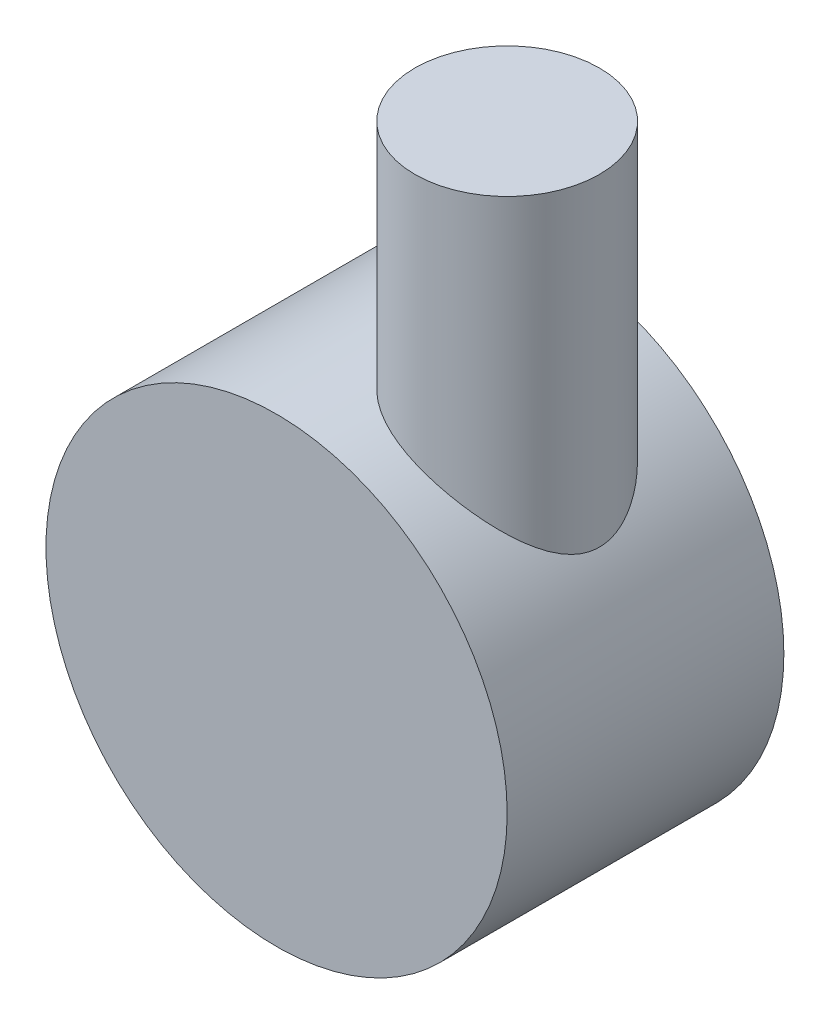
ISO-10303-21;
HEADER;
FILE_DESCRIPTION(('STEP AP214'),'2;1');
FILE_NAME('part.step','',(''),(''),'','','');
FILE_SCHEMA(('AUTOMOTIVE_DESIGN { 1 0 10303 214 1 1 1 1 }'));
ENDSEC;
DATA;
#1=APPLICATION_CONTEXT('core data for automotive mechanical design processes');
#2=APPLICATION_PROTOCOL_DEFINITION('international standard','automotive_design',2000,#1);
#3=PRODUCT_CONTEXT('',#1,'mechanical');
#4=PRODUCT('Part','Part','',(#3));
#5=PRODUCT_RELATED_PRODUCT_CATEGORY('part','',(#4));
#6=PRODUCT_DEFINITION_FORMATION('','',#4);
#7=PRODUCT_DEFINITION_CONTEXT('part definition',#1,'design');
#8=PRODUCT_DEFINITION('design','',#6,#7);
#9=PRODUCT_DEFINITION_SHAPE('','',#8);
#10=(LENGTH_UNIT() NAMED_UNIT(*) SI_UNIT(.MILLI.,.METRE.));
#11=(NAMED_UNIT(*) PLANE_ANGLE_UNIT() SI_UNIT($,.RADIAN.));
#12=(NAMED_UNIT(*) SI_UNIT($,.STERADIAN.) SOLID_ANGLE_UNIT());
#13=UNCERTAINTY_MEASURE_WITH_UNIT(LENGTH_MEASURE(1.E-05),#10,'distance_accuracy_value','');
#14=(GEOMETRIC_REPRESENTATION_CONTEXT(3) GLOBAL_UNCERTAINTY_ASSIGNED_CONTEXT((#13)) GLOBAL_UNIT_ASSIGNED_CONTEXT((#10,
#11,#12)) REPRESENTATION_CONTEXT('',''));
#15=CARTESIAN_POINT('',(0.,0.,0.));
#16=DIRECTION('',(0.,0.,1.));
#17=DIRECTION('',(1.,0.,0.));
#18=AXIS2_PLACEMENT_3D('',#15,#16,#17);
#19=CARTESIAN_POINT('',(0.,0.,30.));
#20=DIRECTION('',(0.,0.,-1.));
#21=DIRECTION('',(-1.,0.,0.));
#22=AXIS2_PLACEMENT_3D('',#19,#20,#21);
#23=CYLINDRICAL_SURFACE('',#22,25.);
#24=CARTESIAN_POINT('',(0.,0.,0.));
#25=DIRECTION('',(0.,0.,1.));
#26=DIRECTION('',(1.,0.,0.));
#27=AXIS2_PLACEMENT_3D('',#24,#25,#26);
#28=CIRCLE('',#27,25.);
#29=CARTESIAN_POINT('',(25.,0.,0.));
#30=VERTEX_POINT('',#29);
#31=EDGE_CURVE('E44',#30,#30,#28,.T.);
#32=ORIENTED_EDGE('',*,*,#31,.T.);
#33=EDGE_LOOP('',(#32));
#34=FACE_BOUND('',#33,.T.);
#35=CARTESIAN_POINT('',(0.,0.,30.));
#36=DIRECTION('',(0.,0.,1.));
#37=DIRECTION('',(1.,0.,0.));
#38=AXIS2_PLACEMENT_3D('',#35,#36,#37);
#39=CIRCLE('',#38,25.);
#40=CARTESIAN_POINT('',(25.,0.,30.));
#41=VERTEX_POINT('',#40);
#42=EDGE_CURVE('E40',#41,#41,#39,.T.);
#43=ORIENTED_EDGE('',*,*,#42,.F.);
#44=EDGE_LOOP('',(#43));
#45=FACE_BOUND('',#44,.T.);
#46=CARTESIAN_POINT('',(10.,22.9128784747792,5.));
#47=CARTESIAN_POINT('',(9.74395274865418,23.0246332525659,4.99999508158958));
#48=CARTESIAN_POINT('',(9.48607902975445,23.1320564122985,5.00983559358378));
#49=CARTESIAN_POINT('',(8.96819070452712,23.337717942223,5.04998592326425));
#50=CARTESIAN_POINT('',(8.70817595497397,23.4359556924302,5.08029712152034));
#51=CARTESIAN_POINT('',(8.18791942694949,23.6227519062562,5.16202649364371));
#52=CARTESIAN_POINT('',(7.92767761374418,23.7113084514143,5.21344884140283));
#53=CARTESIAN_POINT('',(7.40911530519431,23.8784255566922,5.33778513810004));
#54=CARTESIAN_POINT('',(7.15079476522745,23.956986349654,5.41069858629105));
#55=CARTESIAN_POINT('',(6.63763420053793,24.1042165813292,5.5783470512476));
#56=CARTESIAN_POINT('',(6.38280508943463,24.1728595197061,5.67313883514075));
#57=CARTESIAN_POINT('',(5.87963571849291,24.3001489018193,5.88424264824561));
#58=CARTESIAN_POINT('',(5.63129554892842,24.3587952065456,6.00055497666871));
#59=CARTESIAN_POINT('',(5.14342377321489,24.4664587459752,6.25418660270448));
#60=CARTESIAN_POINT('',(4.90389179288228,24.5154763901018,6.39150500666943));
#61=CARTESIAN_POINT('',(4.4358484301732,24.6044712133675,6.6863538318722));
#62=CARTESIAN_POINT('',(4.20733675791638,24.6444486304048,6.84388372106369));
#63=CARTESIAN_POINT('',(3.77222382882678,24.7147115208709,7.17146248080796));
#64=CARTESIAN_POINT('',(3.5651129479655,24.7453186449425,7.34076649460857));
#65=CARTESIAN_POINT('',(3.16464943892371,24.7997143878116,7.69591857548004));
#66=CARTESIAN_POINT('',(2.97129642145454,24.823503199596,7.881766174103));
#67=CARTESIAN_POINT('',(2.59984571501325,24.8651511924953,8.26875510810559));
#68=CARTESIAN_POINT('',(2.42174885604364,24.8830100511465,8.46989727445502));
#69=CARTESIAN_POINT('',(2.0821532878917,24.9137254390399,8.88609421418228));
#70=CARTESIAN_POINT('',(1.92065491953421,24.9265818655799,9.10114927309258));
#71=CARTESIAN_POINT('',(1.61334163370636,24.9483704951518,9.54672564337698));
#72=CARTESIAN_POINT('',(1.46777049381967,24.9572468205724,9.77741781204359));
#73=CARTESIAN_POINT('',(1.19592229118368,24.9717501726439,10.2499971596258));
#74=CARTESIAN_POINT('',(1.06964531974725,24.9773771839174,10.4918843915169));
#75=CARTESIAN_POINT('',(0.837254016077246,24.9862469332782,10.9852224168203));
#76=CARTESIAN_POINT('',(0.731141326829147,24.9894894771409,11.2366739875331));
#77=CARTESIAN_POINT('',(0.539814508538939,24.9943546255284,11.7474223159099));
#78=CARTESIAN_POINT('',(0.45460070039668,24.9959772051801,12.0067191939689));
#79=CARTESIAN_POINT('',(0.303818883036969,24.9982704995468,12.5378589418796));
#80=CARTESIAN_POINT('',(0.238784437884012,24.9989168723248,12.8098535377182));
#81=CARTESIAN_POINT('',(0.131716648618825,24.9997103983013,13.3583358713078));
#82=CARTESIAN_POINT('',(0.0896836742488122,24.999857543475,13.6348236812124));
#83=CARTESIAN_POINT('',(0.0289138305584678,25.0000018026477,14.1903579759888));
#84=CARTESIAN_POINT('',(0.010177765900636,24.9999989114647,14.4694045489034));
#85=CARTESIAN_POINT('',(-0.00386387315887531,25.0000006898979,15.0280859044924));
#86=CARTESIAN_POINT('',(0.00083054374174687,25.0000053595112,15.3077206869484));
#87=CARTESIAN_POINT('',(0.0337154052949025,24.999982706367,15.8672888156708));
#88=CARTESIAN_POINT('',(0.062046504501513,24.9999551916958,16.1472139063603));
#89=CARTESIAN_POINT('',(0.142186774767194,24.9996276942589,16.7036841869424));
#90=CARTESIAN_POINT('',(0.193996097084954,24.9993277097379,16.9802293550481));
#91=CARTESIAN_POINT('',(0.320727905110784,24.9980228120748,17.527987508592));
#92=CARTESIAN_POINT('',(0.39565171168319,24.9970178586436,17.7992001883657));
#93=CARTESIAN_POINT('',(0.568076587653266,24.9936935562444,18.3343436272858));
#94=CARTESIAN_POINT('',(0.665577629051098,24.9913742089065,18.5982743954626));
#95=CARTESIAN_POINT('',(0.882430596719307,24.9846567513175,19.1169054189177));
#96=CARTESIAN_POINT('',(1.0017775561422,24.9802591132239,19.3716077566183));
#97=CARTESIAN_POINT('',(1.26146555688823,24.9684919283459,19.8700076396493));
#98=CARTESIAN_POINT('',(1.40180664176727,24.9611223753957,20.113705162147));
#99=CARTESIAN_POINT('',(1.70242479747288,24.9424220595718,20.5883042165447));
#100=CARTESIAN_POINT('',(1.86270085820941,24.9310914973469,20.8192063959188));
#101=CARTESIAN_POINT('',(2.20195445941364,24.9034204110807,21.2665203035375));
#102=CARTESIAN_POINT('',(2.38093175439566,24.8870799527973,21.4829322219306));
#103=CARTESIAN_POINT('',(2.75404531724813,24.8485412378278,21.8973182696574));
#104=CARTESIAN_POINT('',(2.9479892948464,24.8264106573434,22.0954717972488));
#105=CARTESIAN_POINT('',(3.35116280741475,24.7752091024433,22.4745922686055));
#106=CARTESIAN_POINT('',(3.56039221670149,24.7461381850895,22.6555593536569));
#107=CARTESIAN_POINT('',(3.99228966791369,24.680140213751,22.9989694396401));
#108=CARTESIAN_POINT('',(4.21495415455758,24.6432152316876,23.1614173086605));
#109=CARTESIAN_POINT('',(4.67179642939499,24.5607039624333,23.4667421630612));
#110=CARTESIAN_POINT('',(4.90597394606191,24.5151178794355,23.6096196096953));
#111=CARTESIAN_POINT('',(5.37712485757223,24.4160370679226,23.8712810419954));
#112=CARTESIAN_POINT('',(5.61384302184403,24.3627951296408,23.9906208360291));
#113=CARTESIAN_POINT('',(6.09410870109695,24.2471201804534,24.20943233343));
#114=CARTESIAN_POINT('',(6.33765605692516,24.1846873835949,24.3089044993701));
#115=CARTESIAN_POINT('',(6.82948348168864,24.0504288324105,24.4876914135884));
#116=CARTESIAN_POINT('',(7.07776319429391,23.9786037829203,24.5670076731411));
#117=CARTESIAN_POINT('',(7.57702438796852,23.8255508578537,24.7054780048841));
#118=CARTESIAN_POINT('',(7.82800590594936,23.7443228536678,24.7646318012576));
#119=CARTESIAN_POINT('',(8.33185292477046,23.5722594832219,24.8632391276802));
#120=CARTESIAN_POINT('',(8.58472179903931,23.4813820244073,24.9026016583937));
#121=CARTESIAN_POINT('',(9.08936271921491,23.2906901601945,24.9616908578817));
#122=CARTESIAN_POINT('',(9.34113476814021,23.1908757794079,24.9814175807296));
#123=CARTESIAN_POINT('',(9.84199772501981,22.9827901759487,25.0018936452963));
#124=CARTESIAN_POINT('',(10.0910879397443,22.8745168237198,25.0026381926865));
#125=CARTESIAN_POINT('',(10.5851101827623,22.6501449674866,24.9859274412839));
#126=CARTESIAN_POINT('',(10.8300417003568,22.5340455109934,24.9684699234245));
#127=CARTESIAN_POINT('',(11.3362281404002,22.2839984613635,24.9138778200478));
#128=CARTESIAN_POINT('',(11.5969783052325,22.1493838459887,24.8751197297828));
#129=CARTESIAN_POINT('',(12.1107745568919,21.8726839635874,24.7781896280705));
#130=CARTESIAN_POINT('',(12.3638202546075,21.7305983202241,24.7200166378489));
#131=CARTESIAN_POINT('',(12.8611680957075,21.4399930902089,24.5854099759036));
#132=CARTESIAN_POINT('',(13.1054707435012,21.2914738758228,24.5089773595844));
#133=CARTESIAN_POINT('',(13.5845747716175,20.9890354683963,24.3389214890771));
#134=CARTESIAN_POINT('',(13.8193750437603,20.8351156494154,24.2452962368707));
#135=CARTESIAN_POINT('',(14.3166302463571,20.4972842648155,24.0250930754001));
#136=CARTESIAN_POINT('',(14.5772859836243,20.3126019307803,23.8956282107729));
#137=CARTESIAN_POINT('',(15.0841355852319,19.9391069835223,23.6159945945144));
#138=CARTESIAN_POINT('',(15.3303278735085,19.7502939232447,23.4658235925071));
#139=CARTESIAN_POINT('',(15.8082672082935,19.3698785822733,23.1453684226011));
#140=CARTESIAN_POINT('',(16.0399758041939,19.1782704151523,22.9750339249016));
#141=CARTESIAN_POINT('',(16.4877334498816,18.7947217067157,22.6152355035305));
#142=CARTESIAN_POINT('',(16.7037819146241,18.6027811532565,22.4257708658105));
#143=CARTESIAN_POINT('',(17.1524041040135,18.1907049647092,21.9967174412053));
#144=CARTESIAN_POINT('',(17.3822278483873,17.9708857706338,21.7539327783159));
#145=CARTESIAN_POINT('',(17.8191056982342,17.5377908677891,21.2429691020709));
#146=CARTESIAN_POINT('',(18.0261483364758,17.3245184930561,20.9747774249458));
#147=CARTESIAN_POINT('',(18.4149781350494,16.9106140882536,20.4133462959547));
#148=CARTESIAN_POINT('',(18.5968498076735,16.7099410600277,20.1201962763503));
#149=CARTESIAN_POINT('',(18.9333579718167,16.3276663649453,19.5074625903773));
#150=CARTESIAN_POINT('',(19.0880276603494,16.1460415627106,19.1879118534245));
#151=CARTESIAN_POINT('',(19.3659772447335,15.8115789279219,18.522451791384));
#152=CARTESIAN_POINT('',(19.4893813665267,15.6586278187583,18.1766541087715));
#153=CARTESIAN_POINT('',(19.6472806876957,15.4593532676996,17.639102429716));
#154=CARTESIAN_POINT('',(19.695371111926,15.3979647884125,17.4568216071079));
#155=CARTESIAN_POINT('',(19.7817463802927,15.28683917915,17.0865135370156));
#156=CARTESIAN_POINT('',(19.8200360327816,15.2370963367399,16.8984891582534));
#157=CARTESIAN_POINT('',(19.886469197961,15.1502932062234,16.5152561472572));
#158=CARTESIAN_POINT('',(19.9144829198531,15.1133954363575,16.3199877804574));
#159=CARTESIAN_POINT('',(19.9590169886476,15.0545346396183,15.9258976549048));
#160=CARTESIAN_POINT('',(19.975537890519,15.032570891607,15.7270760682067));
#161=CARTESIAN_POINT('',(19.9966231339882,15.0045119065283,15.3278097242987));
#162=CARTESIAN_POINT('',(20.0011956567653,14.9984058115786,15.1273661720441));
#163=CARTESIAN_POINT('',(19.9982721728689,15.0023037371357,14.7267347789778));
#164=CARTESIAN_POINT('',(19.9907771395091,15.0123064583791,14.5265469188464));
#165=CARTESIAN_POINT('',(19.965757539693,15.0455602383054,14.155331111477));
#166=CARTESIAN_POINT('',(19.9497257142127,15.0668376176094,13.9840194600934));
#167=CARTESIAN_POINT('',(19.9091345865824,15.1204321418829,13.6441315623869));
#168=CARTESIAN_POINT('',(19.8845727151729,15.1527526129966,13.4755561562555));
#169=CARTESIAN_POINT('',(19.7987193626499,15.2649839542951,12.9752921553192));
#170=CARTESIAN_POINT('',(19.7252584341572,15.3601671036439,12.6490417757568));
#171=CARTESIAN_POINT('',(19.5085882083351,15.6351434326781,11.8661135636857));
#172=CARTESIAN_POINT('',(19.3488233598691,15.8336636252182,11.4206792040886));
#173=CARTESIAN_POINT('',(19.0719841946985,16.1641716117304,10.7866110328464));
#174=CARTESIAN_POINT('',(18.9733001815306,16.2800273382293,10.580604782049));
#175=CARTESIAN_POINT('',(18.7644319840241,16.520331973926,10.1796518435617));
#176=CARTESIAN_POINT('',(18.6542478478792,16.6447808471118,9.98470510952976));
#177=CARTESIAN_POINT('',(18.3690289965591,16.9600320765832,9.51677346996898));
#178=CARTESIAN_POINT('',(18.1878178719171,17.1545773092772,9.25007560010521));
#179=CARTESIAN_POINT('',(17.8042110373327,17.5523939664708,8.73930362529875));
#180=CARTESIAN_POINT('',(17.6018059116221,17.7556692455731,8.49523966739974));
#181=CARTESIAN_POINT('',(17.1768661786795,18.1670807569094,8.02919536063701));
#182=CARTESIAN_POINT('',(16.9543118417536,18.3752216022306,7.80723711362116));
#183=CARTESIAN_POINT('',(16.4901553189445,18.7928778425755,7.38579483838895));
#184=CARTESIAN_POINT('',(16.2485561667124,19.0023930138276,7.18630724306669));
#185=CARTESIAN_POINT('',(15.7411459775722,19.4249281771274,6.80597290531021));
#186=CARTESIAN_POINT('',(15.474903070117,19.6379166191462,6.62566641745807));
#187=CARTESIAN_POINT('',(14.9238780195027,20.0598680580042,6.29026638966857));
#188=CARTESIAN_POINT('',(14.6390931918983,20.2688304662652,6.13517651193639));
#189=CARTESIAN_POINT('',(14.0526046421726,20.6797528577756,5.85220598124393));
#190=CARTESIAN_POINT('',(13.7509418448292,20.8817280082562,5.72426283418575));
#191=CARTESIAN_POINT('',(13.1314997323419,21.2767152131802,5.49723887742645));
#192=CARTESIAN_POINT('',(12.8137275372959,21.4697311564233,5.39814544496617));
#193=CARTESIAN_POINT('',(12.0923828006851,21.8856878005721,5.21279901935137));
#194=CARTESIAN_POINT('',(11.6852605080598,22.1059249365757,5.13411054720127));
#195=CARTESIAN_POINT('',(10.853804857406,22.5257962094963,5.02771546712297));
#196=CARTESIAN_POINT('',(10.4294717051932,22.7254305926899,5.00000824971991));
#197=CARTESIAN_POINT('',(10.,22.9128784747792,5.));
#198=B_SPLINE_CURVE_WITH_KNOTS('',3,(#46,#47,#48,#49,#50,#51,#52,#53,#54,#55,#56,#57,#58,#59,
#60,#61,#62,#63,#64,#65,#66,#67,#68,#69,#70,#71,#72,#73,#74,#75,#76,#77,#78,#79,#80,#81,#82,#83,
#84,#85,#86,#87,#88,#89,#90,#91,#92,#93,#94,#95,#96,#97,#98,#99,#100,#101,#102,#103,#104,#105,
#106,#107,#108,#109,#110,#111,#112,#113,#114,#115,#116,#117,#118,#119,#120,#121,#122,#123,#124,
#125,#126,#127,#128,#129,#130,#131,#132,#133,#134,#135,#136,#137,#138,#139,#140,#141,#142,#143,
#144,#145,#146,#147,#148,#149,#150,#151,#152,#153,#154,#155,#156,#157,#158,#159,#160,#161,#162,
#163,#164,#165,#166,#167,#168,#169,#170,#171,#172,#173,#174,#175,#176,#177,#178,#179,#180,#181,
#182,#183,#184,#185,#186,#187,#188,#189,#190,#191,#192,#193,#194,#195,#196,#197),.UNSPECIFIED.,
.T.,.F.,(4,2,2,2,2,2,2,2,2,2,2,2,2,2,2,2,2,2,2,2,2,2,2,2,2,2,2,2,2,2,2,2,2,2,2,2,2,2,2,2,2,2,2,
2,2,2,2,2,2,2,2,2,2,2,2,2,2,2,2,2,2,2,2,2,2,2,2,2,2,2,2,2,2,2,2,4),(0.,0.837788159371604,
1.67563282591446,2.51364322281906,3.35163409545173,4.19182422231219,5.03202603165398,
5.87219210677559,6.71233606993501,7.51914069018817,8.32592247223642,9.1327481189423,
9.93959032928129,10.7574301798282,11.5752739008194,12.3931842311611,13.2111071196332,
14.049106621251,14.8871195930809,15.7251615086159,16.5632031130589,17.4062675107335,
18.2493373399363,19.0924553548216,19.9355723240944,20.7784978414129,21.6214251075489,
22.4643096805881,23.3071831907145,24.1406139291886,24.9740378156107,25.8072421148552,
26.6404267729885,27.450632642352,28.2608196457005,29.0709458839102,29.8810832039749,
30.694912192494,31.5087389398645,32.3227712334433,33.1369027796749,34.0240095999085,
34.9111611491185,35.798261433462,36.6854648762592,37.7185171790472,38.7516818442332,
39.7874820252978,40.8233208827681,42.0221707422132,43.2216213274088,44.4169415993948,
45.6107928369353,46.7998234649034,47.3940561661109,47.9879967698387,48.5892000031416,
49.190374203328,49.791136665305,50.3918506749593,50.9113608021999,51.4310275423876,
52.4702893438946,54.0007951315262,54.7687428555973,55.536687361554,56.6648436942158,
57.7935033718274,58.9232804159102,60.0528778599134,61.2086987503204,62.3646873508086,
63.5179851788286,64.6707776377388,66.0760284616632,67.4812624858709),.UNSPECIFIED.);
#199=CARTESIAN_POINT('',(10.,22.9128784747792,5.));
#200=VERTEX_POINT('',#199);
#201=EDGE_CURVE('E10',#200,#200,#198,.T.);
#202=ORIENTED_EDGE('',*,*,#201,.F.);
#203=EDGE_LOOP('',(#202));
#204=FACE_BOUND('',#203,.T.);
#205=ADVANCED_FACE('F30',(#34,#45,#204),#23,.T.);
#206=CARTESIAN_POINT('',(0.,0.,30.));
#207=DIRECTION('',(0.,0.,1.));
#208=DIRECTION('',(1.,0.,0.));
#209=AXIS2_PLACEMENT_3D('',#206,#207,#208);
#210=PLANE('',#209);
#211=ORIENTED_EDGE('',*,*,#42,.T.);
#212=EDGE_LOOP('',(#211));
#213=FACE_BOUND('',#212,.T.);
#214=ADVANCED_FACE('F64',(#213),#210,.T.);
#215=CARTESIAN_POINT('',(0.,0.,0.));
#216=DIRECTION('',(0.,0.,1.));
#217=DIRECTION('',(1.,0.,0.));
#218=AXIS2_PLACEMENT_3D('',#215,#216,#217);
#219=PLANE('',#218);
#220=ORIENTED_EDGE('',*,*,#31,.F.);
#221=EDGE_LOOP('',(#220));
#222=FACE_BOUND('',#221,.T.);
#223=ADVANCED_FACE('F58',(#222),#219,.F.);
#224=CARTESIAN_POINT('',(10.,50.,15.));
#225=DIRECTION('',(0.,-1.,0.));
#226=DIRECTION('',(0.,0.,-1.));
#227=AXIS2_PLACEMENT_3D('',#224,#225,#226);
#228=CYLINDRICAL_SURFACE('',#227,10.);
#229=CARTESIAN_POINT('',(10.,50.,15.));
#230=DIRECTION('',(0.,1.,0.));
#231=DIRECTION('',(0.,0.,1.));
#232=AXIS2_PLACEMENT_3D('',#229,#230,#231);
#233=CIRCLE('',#232,10.);
#234=CARTESIAN_POINT('',(10.,50.,25.));
#235=VERTEX_POINT('',#234);
#236=EDGE_CURVE('E49',#235,#235,#233,.T.);
#237=ORIENTED_EDGE('',*,*,#236,.F.);
#238=EDGE_LOOP('',(#237));
#239=FACE_BOUND('',#238,.T.);
#240=ORIENTED_EDGE('',*,*,#201,.T.);
#241=EDGE_LOOP('',(#240));
#242=FACE_BOUND('',#241,.T.);
#243=ADVANCED_FACE('F56',(#239,#242),#228,.T.);
#244=CARTESIAN_POINT('',(10.,50.,15.));
#245=DIRECTION('',(0.,1.,0.));
#246=DIRECTION('',(0.,0.,1.));
#247=AXIS2_PLACEMENT_3D('',#244,#245,#246);
#248=PLANE('',#247);
#249=ORIENTED_EDGE('',*,*,#236,.T.);
#250=EDGE_LOOP('',(#249));
#251=FACE_BOUND('',#250,.T.);
#252=ADVANCED_FACE('F54',(#251),#248,.T.);
#253=CLOSED_SHELL('',(#205,#214,#223,#243,#252));
#254=MANIFOLD_SOLID_BREP('B2',#253);
#255=ADVANCED_BREP_SHAPE_REPRESENTATION('',(#18,#254),#14);
#256=SHAPE_DEFINITION_REPRESENTATION(#9,#255);
ENDSEC;
END-ISO-10303-21;
